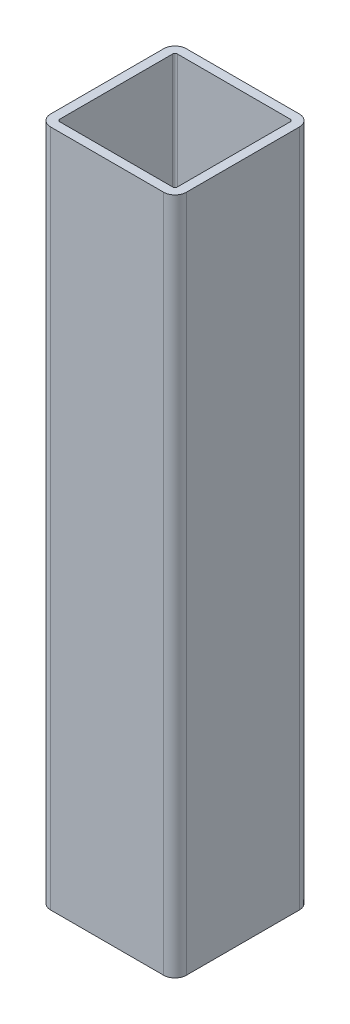
ISO-10303-21;
HEADER;
FILE_DESCRIPTION(('STEP AP214'),'2;1');
FILE_NAME('part.step','',(''),(''),'','','');
FILE_SCHEMA(('AUTOMOTIVE_DESIGN { 1 0 10303 214 1 1 1 1 }'));
ENDSEC;
DATA;
#1=APPLICATION_CONTEXT('core data for automotive mechanical design processes');
#2=APPLICATION_PROTOCOL_DEFINITION('international standard','automotive_design',2000,#1);
#3=PRODUCT_CONTEXT('',#1,'mechanical');
#4=PRODUCT('Part','Part','',(#3));
#5=PRODUCT_RELATED_PRODUCT_CATEGORY('part','',(#4));
#6=PRODUCT_DEFINITION_FORMATION('','',#4);
#7=PRODUCT_DEFINITION_CONTEXT('part definition',#1,'design');
#8=PRODUCT_DEFINITION('design','',#6,#7);
#9=PRODUCT_DEFINITION_SHAPE('','',#8);
#10=(LENGTH_UNIT() NAMED_UNIT(*) SI_UNIT(.MILLI.,.METRE.));
#11=(NAMED_UNIT(*) PLANE_ANGLE_UNIT() SI_UNIT($,.RADIAN.));
#12=(NAMED_UNIT(*) SI_UNIT($,.STERADIAN.) SOLID_ANGLE_UNIT());
#13=UNCERTAINTY_MEASURE_WITH_UNIT(LENGTH_MEASURE(1.E-05),#10,'distance_accuracy_value','');
#14=(GEOMETRIC_REPRESENTATION_CONTEXT(3) GLOBAL_UNCERTAINTY_ASSIGNED_CONTEXT((#13)) GLOBAL_UNIT_ASSIGNED_CONTEXT((#10,
#11,#12)) REPRESENTATION_CONTEXT('',''));
#15=CARTESIAN_POINT('',(0.,0.,0.));
#16=DIRECTION('',(0.,0.,1.));
#17=DIRECTION('',(1.,0.,0.));
#18=AXIS2_PLACEMENT_3D('',#15,#16,#17);
#19=CARTESIAN_POINT('',(-15.875,95.25,15.875));
#20=DIRECTION('',(0.,1.,0.));
#21=DIRECTION('',(0.,0.,1.));
#22=AXIS2_PLACEMENT_3D('',#19,#20,#21);
#23=PLANE('',#22);
#24=CARTESIAN_POINT('',(-15.875,95.25,15.875));
#25=DIRECTION('',(0.,1.,0.));
#26=DIRECTION('',(0.,0.,1.));
#27=AXIS2_PLACEMENT_3D('',#24,#25,#26);
#28=CIRCLE('',#27,3.175);
#29=CARTESIAN_POINT('',(-19.05,95.25,15.875));
#30=VERTEX_POINT('',#29);
#31=CARTESIAN_POINT('',(-15.875,95.25,19.05));
#32=VERTEX_POINT('',#31);
#33=EDGE_CURVE('E259',#30,#32,#28,.T.);
#34=ORIENTED_EDGE('',*,*,#33,.T.);
#35=DIRECTION('',(1.,0.,0.));
#36=VECTOR('',#35,1.);
#37=CARTESIAN_POINT('',(-15.875,95.25,19.05));
#38=LINE('',#37,#36);
#39=CARTESIAN_POINT('',(15.875,95.25,19.05));
#40=VERTEX_POINT('',#39);
#41=EDGE_CURVE('E262',#32,#40,#38,.T.);
#42=ORIENTED_EDGE('',*,*,#41,.T.);
#43=CARTESIAN_POINT('',(15.875,95.25,15.875));
#44=DIRECTION('',(0.,1.,0.));
#45=DIRECTION('',(0.,0.,1.));
#46=AXIS2_PLACEMENT_3D('',#43,#44,#45);
#47=CIRCLE('',#46,3.175);
#48=CARTESIAN_POINT('',(19.05,95.25,15.875));
#49=VERTEX_POINT('',#48);
#50=EDGE_CURVE('E265',#40,#49,#47,.T.);
#51=ORIENTED_EDGE('',*,*,#50,.T.);
#52=DIRECTION('',(0.,0.,-1.));
#53=VECTOR('',#52,1.);
#54=CARTESIAN_POINT('',(19.05,95.25,-15.875));
#55=LINE('',#54,#53);
#56=CARTESIAN_POINT('',(19.05,95.25,-15.875));
#57=VERTEX_POINT('',#56);
#58=EDGE_CURVE('E267',#49,#57,#55,.T.);
#59=ORIENTED_EDGE('',*,*,#58,.T.);
#60=CARTESIAN_POINT('',(15.875,95.25,-15.875));
#61=DIRECTION('',(0.,1.,0.));
#62=DIRECTION('',(0.,0.,1.));
#63=AXIS2_PLACEMENT_3D('',#60,#61,#62);
#64=CIRCLE('',#63,3.175);
#65=CARTESIAN_POINT('',(15.875,95.25,-19.05));
#66=VERTEX_POINT('',#65);
#67=EDGE_CURVE('E269',#57,#66,#64,.T.);
#68=ORIENTED_EDGE('',*,*,#67,.T.);
#69=DIRECTION('',(-1.,0.,0.));
#70=VECTOR('',#69,1.);
#71=CARTESIAN_POINT('',(-15.875,95.25,-19.05));
#72=LINE('',#71,#70);
#73=CARTESIAN_POINT('',(-15.875,95.25,-19.05));
#74=VERTEX_POINT('',#73);
#75=EDGE_CURVE('E271',#66,#74,#72,.T.);
#76=ORIENTED_EDGE('',*,*,#75,.T.);
#77=CARTESIAN_POINT('',(-15.875,95.25,-15.875));
#78=DIRECTION('',(0.,1.,0.));
#79=DIRECTION('',(0.,0.,1.));
#80=AXIS2_PLACEMENT_3D('',#77,#78,#79);
#81=CIRCLE('',#80,3.175);
#82=CARTESIAN_POINT('',(-19.05,95.25,-15.875));
#83=VERTEX_POINT('',#82);
#84=EDGE_CURVE('E273',#74,#83,#81,.T.);
#85=ORIENTED_EDGE('',*,*,#84,.T.);
#86=DIRECTION('',(0.,0.,1.));
#87=VECTOR('',#86,1.);
#88=CARTESIAN_POINT('',(-19.05,95.25,-15.875));
#89=LINE('',#88,#87);
#90=EDGE_CURVE('E275',#83,#30,#89,.T.);
#91=ORIENTED_EDGE('',*,*,#90,.T.);
#92=EDGE_LOOP('',(#34,#42,#51,#59,#68,#76,#85,#91));
#93=FACE_BOUND('',#92,.T.);
#94=DIRECTION('',(1.,0.,0.));
#95=VECTOR('',#94,1.);
#96=CARTESIAN_POINT('',(-15.875,95.25,16.51));
#97=LINE('',#96,#95);
#98=CARTESIAN_POINT('',(-15.875,95.25,16.51));
#99=VERTEX_POINT('',#98);
#100=CARTESIAN_POINT('',(15.875,95.25,16.51));
#101=VERTEX_POINT('',#100);
#102=EDGE_CURVE('E202',#99,#101,#97,.T.);
#103=ORIENTED_EDGE('',*,*,#102,.F.);
#104=CARTESIAN_POINT('',(-15.875,95.25,15.875));
#105=DIRECTION('',(0.,1.,0.));
#106=DIRECTION('',(1.,0.,0.));
#107=AXIS2_PLACEMENT_3D('',#104,#105,#106);
#108=CIRCLE('',#107,0.635000000000002);
#109=CARTESIAN_POINT('',(-16.51,95.25,15.875));
#110=VERTEX_POINT('',#109);
#111=EDGE_CURVE('E194',#110,#99,#108,.T.);
#112=ORIENTED_EDGE('',*,*,#111,.F.);
#113=DIRECTION('',(0.,0.,1.));
#114=VECTOR('',#113,1.);
#115=CARTESIAN_POINT('',(-16.51,95.25,-15.875));
#116=LINE('',#115,#114);
#117=CARTESIAN_POINT('',(-16.51,95.25,-15.875));
#118=VERTEX_POINT('',#117);
#119=EDGE_CURVE('E227',#118,#110,#116,.T.);
#120=ORIENTED_EDGE('',*,*,#119,.F.);
#121=CARTESIAN_POINT('',(-15.875,95.25,-15.875));
#122=DIRECTION('',(0.,1.,0.));
#123=DIRECTION('',(1.,0.,0.));
#124=AXIS2_PLACEMENT_3D('',#121,#122,#123);
#125=CIRCLE('',#124,0.635000000000004);
#126=CARTESIAN_POINT('',(-15.875,95.25,-16.51));
#127=VERTEX_POINT('',#126);
#128=EDGE_CURVE('E225',#127,#118,#125,.T.);
#129=ORIENTED_EDGE('',*,*,#128,.F.);
#130=DIRECTION('',(-1.,0.,0.));
#131=VECTOR('',#130,1.);
#132=CARTESIAN_POINT('',(-15.875,95.25,-16.51));
#133=LINE('',#132,#131);
#134=CARTESIAN_POINT('',(15.875,95.25,-16.51));
#135=VERTEX_POINT('',#134);
#136=EDGE_CURVE('E223',#135,#127,#133,.T.);
#137=ORIENTED_EDGE('',*,*,#136,.F.);
#138=CARTESIAN_POINT('',(15.875,95.25,-15.875));
#139=DIRECTION('',(0.,1.,0.));
#140=DIRECTION('',(1.,0.,0.));
#141=AXIS2_PLACEMENT_3D('',#138,#139,#140);
#142=CIRCLE('',#141,0.635000000000004);
#143=CARTESIAN_POINT('',(16.51,95.25,-15.875));
#144=VERTEX_POINT('',#143);
#145=EDGE_CURVE('E221',#144,#135,#142,.T.);
#146=ORIENTED_EDGE('',*,*,#145,.F.);
#147=DIRECTION('',(0.,0.,-1.));
#148=VECTOR('',#147,1.);
#149=CARTESIAN_POINT('',(16.51,95.25,-15.875));
#150=LINE('',#149,#148);
#151=CARTESIAN_POINT('',(16.51,95.25,15.875));
#152=VERTEX_POINT('',#151);
#153=EDGE_CURVE('E217',#152,#144,#150,.T.);
#154=ORIENTED_EDGE('',*,*,#153,.F.);
#155=CARTESIAN_POINT('',(15.875,95.25,15.875));
#156=DIRECTION('',(0.,1.,0.));
#157=DIRECTION('',(1.,0.,0.));
#158=AXIS2_PLACEMENT_3D('',#155,#156,#157);
#159=CIRCLE('',#158,0.634999999999999);
#160=EDGE_CURVE('E215',#101,#152,#159,.T.);
#161=ORIENTED_EDGE('',*,*,#160,.F.);
#162=EDGE_LOOP('',(#103,#112,#120,#129,#137,#146,#154,#161));
#163=FACE_BOUND('',#162,.T.);
#164=ADVANCED_FACE('F81',(#93,#163),#23,.T.);
#165=CARTESIAN_POINT('',(-15.875,-95.25,15.875));
#166=DIRECTION('',(0.,1.,0.));
#167=DIRECTION('',(0.,0.,1.));
#168=AXIS2_PLACEMENT_3D('',#165,#166,#167);
#169=PLANE('',#168);
#170=CARTESIAN_POINT('',(-15.875,-95.25,15.875));
#171=DIRECTION('',(0.,1.,0.));
#172=DIRECTION('',(0.,0.,1.));
#173=AXIS2_PLACEMENT_3D('',#170,#171,#172);
#174=CIRCLE('',#173,3.175);
#175=CARTESIAN_POINT('',(-19.05,-95.25,15.875));
#176=VERTEX_POINT('',#175);
#177=CARTESIAN_POINT('',(-15.875,-95.25,19.05));
#178=VERTEX_POINT('',#177);
#179=EDGE_CURVE('E210',#176,#178,#174,.T.);
#180=ORIENTED_EDGE('',*,*,#179,.F.);
#181=DIRECTION('',(0.,0.,1.));
#182=VECTOR('',#181,1.);
#183=CARTESIAN_POINT('',(-19.05,-95.25,-15.875));
#184=LINE('',#183,#182);
#185=CARTESIAN_POINT('',(-19.05,-95.25,-15.875));
#186=VERTEX_POINT('',#185);
#187=EDGE_CURVE('E263',#186,#176,#184,.T.);
#188=ORIENTED_EDGE('',*,*,#187,.F.);
#189=CARTESIAN_POINT('',(-15.875,-95.25,-15.875));
#190=DIRECTION('',(0.,1.,0.));
#191=DIRECTION('',(0.,0.,1.));
#192=AXIS2_PLACEMENT_3D('',#189,#190,#191);
#193=CIRCLE('',#192,3.175);
#194=CARTESIAN_POINT('',(-15.875,-95.25,-19.05));
#195=VERTEX_POINT('',#194);
#196=EDGE_CURVE('E290',#195,#186,#193,.T.);
#197=ORIENTED_EDGE('',*,*,#196,.F.);
#198=DIRECTION('',(-1.,0.,0.));
#199=VECTOR('',#198,1.);
#200=CARTESIAN_POINT('',(-15.875,-95.25,-19.05));
#201=LINE('',#200,#199);
#202=CARTESIAN_POINT('',(15.875,-95.25,-19.05));
#203=VERTEX_POINT('',#202);
#204=EDGE_CURVE('E288',#203,#195,#201,.T.);
#205=ORIENTED_EDGE('',*,*,#204,.F.);
#206=CARTESIAN_POINT('',(15.875,-95.25,-15.875));
#207=DIRECTION('',(0.,1.,0.));
#208=DIRECTION('',(0.,0.,1.));
#209=AXIS2_PLACEMENT_3D('',#206,#207,#208);
#210=CIRCLE('',#209,3.175);
#211=CARTESIAN_POINT('',(19.05,-95.25,-15.875));
#212=VERTEX_POINT('',#211);
#213=EDGE_CURVE('E286',#212,#203,#210,.T.);
#214=ORIENTED_EDGE('',*,*,#213,.F.);
#215=DIRECTION('',(0.,0.,-1.));
#216=VECTOR('',#215,1.);
#217=CARTESIAN_POINT('',(19.05,-95.25,-15.875));
#218=LINE('',#217,#216);
#219=CARTESIAN_POINT('',(19.05,-95.25,15.875));
#220=VERTEX_POINT('',#219);
#221=EDGE_CURVE('E284',#220,#212,#218,.T.);
#222=ORIENTED_EDGE('',*,*,#221,.F.);
#223=CARTESIAN_POINT('',(15.875,-95.25,15.875));
#224=DIRECTION('',(0.,1.,0.));
#225=DIRECTION('',(0.,0.,1.));
#226=AXIS2_PLACEMENT_3D('',#223,#224,#225);
#227=CIRCLE('',#226,3.175);
#228=CARTESIAN_POINT('',(15.875,-95.25,19.05));
#229=VERTEX_POINT('',#228);
#230=EDGE_CURVE('E282',#229,#220,#227,.T.);
#231=ORIENTED_EDGE('',*,*,#230,.F.);
#232=DIRECTION('',(1.,0.,0.));
#233=VECTOR('',#232,1.);
#234=CARTESIAN_POINT('',(-15.875,-95.25,19.05));
#235=LINE('',#234,#233);
#236=EDGE_CURVE('E280',#178,#229,#235,.T.);
#237=ORIENTED_EDGE('',*,*,#236,.F.);
#238=EDGE_LOOP('',(#180,#188,#197,#205,#214,#222,#231,#237));
#239=FACE_BOUND('',#238,.T.);
#240=CARTESIAN_POINT('',(-15.875,-95.25,15.875));
#241=DIRECTION('',(0.,1.,0.));
#242=DIRECTION('',(1.,0.,0.));
#243=AXIS2_PLACEMENT_3D('',#240,#241,#242);
#244=CIRCLE('',#243,0.635000000000002);
#245=CARTESIAN_POINT('',(-16.51,-95.25,15.875));
#246=VERTEX_POINT('',#245);
#247=CARTESIAN_POINT('',(-15.875,-95.25,16.51));
#248=VERTEX_POINT('',#247);
#249=EDGE_CURVE('E104',#246,#248,#244,.T.);
#250=ORIENTED_EDGE('',*,*,#249,.T.);
#251=DIRECTION('',(1.,0.,0.));
#252=VECTOR('',#251,1.);
#253=CARTESIAN_POINT('',(-15.875,-95.25,16.51));
#254=LINE('',#253,#252);
#255=CARTESIAN_POINT('',(15.875,-95.25,16.51));
#256=VERTEX_POINT('',#255);
#257=EDGE_CURVE('E209',#248,#256,#254,.T.);
#258=ORIENTED_EDGE('',*,*,#257,.T.);
#259=CARTESIAN_POINT('',(15.875,-95.25,15.875));
#260=DIRECTION('',(0.,1.,0.));
#261=DIRECTION('',(1.,0.,0.));
#262=AXIS2_PLACEMENT_3D('',#259,#260,#261);
#263=CIRCLE('',#262,0.634999999999999);
#264=CARTESIAN_POINT('',(16.51,-95.25,15.875));
#265=VERTEX_POINT('',#264);
#266=EDGE_CURVE('E231',#256,#265,#263,.T.);
#267=ORIENTED_EDGE('',*,*,#266,.T.);
#268=DIRECTION('',(0.,0.,-1.));
#269=VECTOR('',#268,1.);
#270=CARTESIAN_POINT('',(16.51,-95.25,-15.875));
#271=LINE('',#270,#269);
#272=CARTESIAN_POINT('',(16.51,-95.25,-15.875));
#273=VERTEX_POINT('',#272);
#274=EDGE_CURVE('E234',#265,#273,#271,.T.);
#275=ORIENTED_EDGE('',*,*,#274,.T.);
#276=CARTESIAN_POINT('',(15.875,-95.25,-15.875));
#277=DIRECTION('',(0.,1.,0.));
#278=DIRECTION('',(1.,0.,0.));
#279=AXIS2_PLACEMENT_3D('',#276,#277,#278);
#280=CIRCLE('',#279,0.635000000000004);
#281=CARTESIAN_POINT('',(15.875,-95.25,-16.51));
#282=VERTEX_POINT('',#281);
#283=EDGE_CURVE('E237',#273,#282,#280,.T.);
#284=ORIENTED_EDGE('',*,*,#283,.T.);
#285=DIRECTION('',(-1.,0.,0.));
#286=VECTOR('',#285,1.);
#287=CARTESIAN_POINT('',(-15.875,-95.25,-16.51));
#288=LINE('',#287,#286);
#289=CARTESIAN_POINT('',(-15.875,-95.25,-16.51));
#290=VERTEX_POINT('',#289);
#291=EDGE_CURVE('E240',#282,#290,#288,.T.);
#292=ORIENTED_EDGE('',*,*,#291,.T.);
#293=CARTESIAN_POINT('',(-15.875,-95.25,-15.875));
#294=DIRECTION('',(0.,1.,0.));
#295=DIRECTION('',(1.,0.,0.));
#296=AXIS2_PLACEMENT_3D('',#293,#294,#295);
#297=CIRCLE('',#296,0.635000000000004);
#298=CARTESIAN_POINT('',(-16.51,-95.25,-15.875));
#299=VERTEX_POINT('',#298);
#300=EDGE_CURVE('E243',#290,#299,#297,.T.);
#301=ORIENTED_EDGE('',*,*,#300,.T.);
#302=DIRECTION('',(0.,0.,1.));
#303=VECTOR('',#302,1.);
#304=CARTESIAN_POINT('',(-16.51,-95.25,-15.875));
#305=LINE('',#304,#303);
#306=EDGE_CURVE('E203',#299,#246,#305,.T.);
#307=ORIENTED_EDGE('',*,*,#306,.T.);
#308=EDGE_LOOP('',(#250,#258,#267,#275,#284,#292,#301,#307));
#309=FACE_BOUND('',#308,.T.);
#310=ADVANCED_FACE('F320',(#239,#309),#169,.F.);
#311=CARTESIAN_POINT('',(-15.875,95.25,15.875));
#312=DIRECTION('',(0.,-1.,0.));
#313=DIRECTION('',(0.,0.,-1.));
#314=AXIS2_PLACEMENT_3D('',#311,#312,#313);
#315=CYLINDRICAL_SURFACE('',#314,3.175);
#316=ORIENTED_EDGE('',*,*,#179,.T.);
#317=DIRECTION('',(0.,-1.,0.));
#318=VECTOR('',#317,1.);
#319=CARTESIAN_POINT('',(-15.875,95.25,19.05));
#320=LINE('',#319,#318);
#321=EDGE_CURVE('E12',#32,#178,#320,.T.);
#322=ORIENTED_EDGE('',*,*,#321,.F.);
#323=ORIENTED_EDGE('',*,*,#33,.F.);
#324=DIRECTION('',(0.,-1.,0.));
#325=VECTOR('',#324,1.);
#326=CARTESIAN_POINT('',(-19.05,95.25,15.875));
#327=LINE('',#326,#325);
#328=EDGE_CURVE('E277',#30,#176,#327,.T.);
#329=ORIENTED_EDGE('',*,*,#328,.T.);
#330=EDGE_LOOP('',(#316,#322,#323,#329));
#331=FACE_BOUND('',#330,.T.);
#332=ADVANCED_FACE('F83',(#331),#315,.T.);
#333=CARTESIAN_POINT('',(-15.875,95.25,19.05));
#334=DIRECTION('',(0.,0.,-1.));
#335=DIRECTION('',(-1.,0.,0.));
#336=AXIS2_PLACEMENT_3D('',#333,#334,#335);
#337=PLANE('',#336);
#338=ORIENTED_EDGE('',*,*,#236,.T.);
#339=DIRECTION('',(0.,-1.,0.));
#340=VECTOR('',#339,1.);
#341=CARTESIAN_POINT('',(15.875,95.25,19.05));
#342=LINE('',#341,#340);
#343=EDGE_CURVE('E89',#40,#229,#342,.T.);
#344=ORIENTED_EDGE('',*,*,#343,.F.);
#345=ORIENTED_EDGE('',*,*,#41,.F.);
#346=ORIENTED_EDGE('',*,*,#321,.T.);
#347=EDGE_LOOP('',(#338,#344,#345,#346));
#348=FACE_BOUND('',#347,.T.);
#349=ADVANCED_FACE('F337',(#348),#337,.F.);
#350=CARTESIAN_POINT('',(15.875,95.25,15.875));
#351=DIRECTION('',(0.,-1.,0.));
#352=DIRECTION('',(0.,0.,-1.));
#353=AXIS2_PLACEMENT_3D('',#350,#351,#352);
#354=CYLINDRICAL_SURFACE('',#353,3.175);
#355=ORIENTED_EDGE('',*,*,#230,.T.);
#356=DIRECTION('',(0.,-1.,0.));
#357=VECTOR('',#356,1.);
#358=CARTESIAN_POINT('',(19.05,95.25,15.875));
#359=LINE('',#358,#357);
#360=EDGE_CURVE('E307',#49,#220,#359,.T.);
#361=ORIENTED_EDGE('',*,*,#360,.F.);
#362=ORIENTED_EDGE('',*,*,#50,.F.);
#363=ORIENTED_EDGE('',*,*,#343,.T.);
#364=EDGE_LOOP('',(#355,#361,#362,#363));
#365=FACE_BOUND('',#364,.T.);
#366=ADVANCED_FACE('F314',(#365),#354,.T.);
#367=CARTESIAN_POINT('',(19.05,95.25,-15.875));
#368=DIRECTION('',(-1.,0.,0.));
#369=DIRECTION('',(0.,0.,1.));
#370=AXIS2_PLACEMENT_3D('',#367,#368,#369);
#371=PLANE('',#370);
#372=ORIENTED_EDGE('',*,*,#221,.T.);
#373=DIRECTION('',(0.,-1.,0.));
#374=VECTOR('',#373,1.);
#375=CARTESIAN_POINT('',(19.05,95.25,-15.875));
#376=LINE('',#375,#374);
#377=EDGE_CURVE('E304',#57,#212,#376,.T.);
#378=ORIENTED_EDGE('',*,*,#377,.F.);
#379=ORIENTED_EDGE('',*,*,#58,.F.);
#380=ORIENTED_EDGE('',*,*,#360,.T.);
#381=EDGE_LOOP('',(#372,#378,#379,#380));
#382=FACE_BOUND('',#381,.T.);
#383=ADVANCED_FACE('F326',(#382),#371,.F.);
#384=CARTESIAN_POINT('',(15.875,95.25,-15.875));
#385=DIRECTION('',(0.,-1.,0.));
#386=DIRECTION('',(0.,0.,-1.));
#387=AXIS2_PLACEMENT_3D('',#384,#385,#386);
#388=CYLINDRICAL_SURFACE('',#387,3.175);
#389=ORIENTED_EDGE('',*,*,#213,.T.);
#390=DIRECTION('',(0.,-1.,0.));
#391=VECTOR('',#390,1.);
#392=CARTESIAN_POINT('',(15.875,95.25,-19.05));
#393=LINE('',#392,#391);
#394=EDGE_CURVE('E301',#66,#203,#393,.T.);
#395=ORIENTED_EDGE('',*,*,#394,.F.);
#396=ORIENTED_EDGE('',*,*,#67,.F.);
#397=ORIENTED_EDGE('',*,*,#377,.T.);
#398=EDGE_LOOP('',(#389,#395,#396,#397));
#399=FACE_BOUND('',#398,.T.);
#400=ADVANCED_FACE('F330',(#399),#388,.T.);
#401=CARTESIAN_POINT('',(-15.875,95.25,-19.05));
#402=DIRECTION('',(0.,0.,1.));
#403=DIRECTION('',(1.,0.,0.));
#404=AXIS2_PLACEMENT_3D('',#401,#402,#403);
#405=PLANE('',#404);
#406=ORIENTED_EDGE('',*,*,#204,.T.);
#407=DIRECTION('',(0.,-1.,0.));
#408=VECTOR('',#407,1.);
#409=CARTESIAN_POINT('',(-15.875,95.25,-19.05));
#410=LINE('',#409,#408);
#411=EDGE_CURVE('E298',#74,#195,#410,.T.);
#412=ORIENTED_EDGE('',*,*,#411,.F.);
#413=ORIENTED_EDGE('',*,*,#75,.F.);
#414=ORIENTED_EDGE('',*,*,#394,.T.);
#415=EDGE_LOOP('',(#406,#412,#413,#414));
#416=FACE_BOUND('',#415,.T.);
#417=ADVANCED_FACE('F350',(#416),#405,.F.);
#418=CARTESIAN_POINT('',(-15.875,95.25,-15.875));
#419=DIRECTION('',(0.,-1.,0.));
#420=DIRECTION('',(0.,0.,-1.));
#421=AXIS2_PLACEMENT_3D('',#418,#419,#420);
#422=CYLINDRICAL_SURFACE('',#421,3.175);
#423=ORIENTED_EDGE('',*,*,#196,.T.);
#424=DIRECTION('',(0.,-1.,0.));
#425=VECTOR('',#424,1.);
#426=CARTESIAN_POINT('',(-19.05,95.25,-15.875));
#427=LINE('',#426,#425);
#428=EDGE_CURVE('E295',#83,#186,#427,.T.);
#429=ORIENTED_EDGE('',*,*,#428,.F.);
#430=ORIENTED_EDGE('',*,*,#84,.F.);
#431=ORIENTED_EDGE('',*,*,#411,.T.);
#432=EDGE_LOOP('',(#423,#429,#430,#431));
#433=FACE_BOUND('',#432,.T.);
#434=ADVANCED_FACE('F348',(#433),#422,.T.);
#435=CARTESIAN_POINT('',(-19.05,95.25,-15.875));
#436=DIRECTION('',(1.,0.,0.));
#437=DIRECTION('',(0.,0.,-1.));
#438=AXIS2_PLACEMENT_3D('',#435,#436,#437);
#439=PLANE('',#438);
#440=ORIENTED_EDGE('',*,*,#187,.T.);
#441=ORIENTED_EDGE('',*,*,#328,.F.);
#442=ORIENTED_EDGE('',*,*,#90,.F.);
#443=ORIENTED_EDGE('',*,*,#428,.T.);
#444=EDGE_LOOP('',(#440,#441,#442,#443));
#445=FACE_BOUND('',#444,.T.);
#446=ADVANCED_FACE('F343',(#445),#439,.F.);
#447=CARTESIAN_POINT('',(-15.875,95.25,15.875));
#448=DIRECTION('',(0.,-1.,0.));
#449=DIRECTION('',(0.,0.,-1.));
#450=AXIS2_PLACEMENT_3D('',#447,#448,#449);
#451=CYLINDRICAL_SURFACE('',#450,0.635000000000002);
#452=ORIENTED_EDGE('',*,*,#249,.F.);
#453=DIRECTION('',(0.,-1.,0.));
#454=VECTOR('',#453,1.);
#455=CARTESIAN_POINT('',(-16.51,95.25,15.875));
#456=LINE('',#455,#454);
#457=EDGE_CURVE('E198',#110,#246,#456,.T.);
#458=ORIENTED_EDGE('',*,*,#457,.F.);
#459=ORIENTED_EDGE('',*,*,#111,.T.);
#460=DIRECTION('',(0.,-1.,0.));
#461=VECTOR('',#460,1.);
#462=CARTESIAN_POINT('',(-15.875,95.25,16.51));
#463=LINE('',#462,#461);
#464=EDGE_CURVE('E197',#99,#248,#463,.T.);
#465=ORIENTED_EDGE('',*,*,#464,.T.);
#466=EDGE_LOOP('',(#452,#458,#459,#465));
#467=FACE_BOUND('',#466,.T.);
#468=ADVANCED_FACE('F196',(#467),#451,.F.);
#469=CARTESIAN_POINT('',(-15.875,95.25,16.51));
#470=DIRECTION('',(0.,0.,-1.));
#471=DIRECTION('',(-1.,0.,0.));
#472=AXIS2_PLACEMENT_3D('',#469,#470,#471);
#473=PLANE('',#472);
#474=ORIENTED_EDGE('',*,*,#257,.F.);
#475=ORIENTED_EDGE('',*,*,#464,.F.);
#476=ORIENTED_EDGE('',*,*,#102,.T.);
#477=DIRECTION('',(0.,-1.,0.));
#478=VECTOR('',#477,1.);
#479=CARTESIAN_POINT('',(15.875,95.25,16.51));
#480=LINE('',#479,#478);
#481=EDGE_CURVE('E211',#101,#256,#480,.T.);
#482=ORIENTED_EDGE('',*,*,#481,.T.);
#483=EDGE_LOOP('',(#474,#475,#476,#482));
#484=FACE_BOUND('',#483,.T.);
#485=ADVANCED_FACE('F206',(#484),#473,.T.);
#486=CARTESIAN_POINT('',(15.875,95.25,15.875));
#487=DIRECTION('',(0.,-1.,0.));
#488=DIRECTION('',(0.,0.,-1.));
#489=AXIS2_PLACEMENT_3D('',#486,#487,#488);
#490=CYLINDRICAL_SURFACE('',#489,0.634999999999999);
#491=ORIENTED_EDGE('',*,*,#266,.F.);
#492=ORIENTED_EDGE('',*,*,#481,.F.);
#493=ORIENTED_EDGE('',*,*,#160,.T.);
#494=DIRECTION('',(0.,-1.,0.));
#495=VECTOR('',#494,1.);
#496=CARTESIAN_POINT('',(16.51,95.25,15.875));
#497=LINE('',#496,#495);
#498=EDGE_CURVE('E256',#152,#265,#497,.T.);
#499=ORIENTED_EDGE('',*,*,#498,.T.);
#500=EDGE_LOOP('',(#491,#492,#493,#499));
#501=FACE_BOUND('',#500,.T.);
#502=ADVANCED_FACE('F375',(#501),#490,.F.);
#503=CARTESIAN_POINT('',(16.51,95.25,-15.875));
#504=DIRECTION('',(-1.,0.,0.));
#505=DIRECTION('',(0.,0.,1.));
#506=AXIS2_PLACEMENT_3D('',#503,#504,#505);
#507=PLANE('',#506);
#508=ORIENTED_EDGE('',*,*,#274,.F.);
#509=ORIENTED_EDGE('',*,*,#498,.F.);
#510=ORIENTED_EDGE('',*,*,#153,.T.);
#511=DIRECTION('',(0.,-1.,0.));
#512=VECTOR('',#511,1.);
#513=CARTESIAN_POINT('',(16.51,95.25,-15.875));
#514=LINE('',#513,#512);
#515=EDGE_CURVE('E254',#144,#273,#514,.T.);
#516=ORIENTED_EDGE('',*,*,#515,.T.);
#517=EDGE_LOOP('',(#508,#509,#510,#516));
#518=FACE_BOUND('',#517,.T.);
#519=ADVANCED_FACE('F379',(#518),#507,.T.);
#520=CARTESIAN_POINT('',(15.875,95.25,-15.875));
#521=DIRECTION('',(0.,-1.,0.));
#522=DIRECTION('',(0.,0.,-1.));
#523=AXIS2_PLACEMENT_3D('',#520,#521,#522);
#524=CYLINDRICAL_SURFACE('',#523,0.635000000000004);
#525=ORIENTED_EDGE('',*,*,#283,.F.);
#526=ORIENTED_EDGE('',*,*,#515,.F.);
#527=ORIENTED_EDGE('',*,*,#145,.T.);
#528=DIRECTION('',(0.,-1.,0.));
#529=VECTOR('',#528,1.);
#530=CARTESIAN_POINT('',(15.875,95.25,-16.51));
#531=LINE('',#530,#529);
#532=EDGE_CURVE('E252',#135,#282,#531,.T.);
#533=ORIENTED_EDGE('',*,*,#532,.T.);
#534=EDGE_LOOP('',(#525,#526,#527,#533));
#535=FACE_BOUND('',#534,.T.);
#536=ADVANCED_FACE('F385',(#535),#524,.F.);
#537=CARTESIAN_POINT('',(-15.875,95.25,-16.51));
#538=DIRECTION('',(0.,0.,1.));
#539=DIRECTION('',(1.,0.,0.));
#540=AXIS2_PLACEMENT_3D('',#537,#538,#539);
#541=PLANE('',#540);
#542=ORIENTED_EDGE('',*,*,#291,.F.);
#543=ORIENTED_EDGE('',*,*,#532,.F.);
#544=ORIENTED_EDGE('',*,*,#136,.T.);
#545=DIRECTION('',(0.,-1.,0.));
#546=VECTOR('',#545,1.);
#547=CARTESIAN_POINT('',(-15.875,95.25,-16.51));
#548=LINE('',#547,#546);
#549=EDGE_CURVE('E250',#127,#290,#548,.T.);
#550=ORIENTED_EDGE('',*,*,#549,.T.);
#551=EDGE_LOOP('',(#542,#543,#544,#550));
#552=FACE_BOUND('',#551,.T.);
#553=ADVANCED_FACE('F389',(#552),#541,.T.);
#554=CARTESIAN_POINT('',(-15.875,95.25,-15.875));
#555=DIRECTION('',(0.,-1.,0.));
#556=DIRECTION('',(0.,0.,-1.));
#557=AXIS2_PLACEMENT_3D('',#554,#555,#556);
#558=CYLINDRICAL_SURFACE('',#557,0.635000000000004);
#559=ORIENTED_EDGE('',*,*,#300,.F.);
#560=ORIENTED_EDGE('',*,*,#549,.F.);
#561=ORIENTED_EDGE('',*,*,#128,.T.);
#562=DIRECTION('',(0.,-1.,0.));
#563=VECTOR('',#562,1.);
#564=CARTESIAN_POINT('',(-16.51,95.25,-15.875));
#565=LINE('',#564,#563);
#566=EDGE_CURVE('E96',#118,#299,#565,.T.);
#567=ORIENTED_EDGE('',*,*,#566,.T.);
#568=EDGE_LOOP('',(#559,#560,#561,#567));
#569=FACE_BOUND('',#568,.T.);
#570=ADVANCED_FACE('F393',(#569),#558,.F.);
#571=CARTESIAN_POINT('',(-16.51,95.25,-15.875));
#572=DIRECTION('',(1.,0.,0.));
#573=DIRECTION('',(0.,0.,-1.));
#574=AXIS2_PLACEMENT_3D('',#571,#572,#573);
#575=PLANE('',#574);
#576=ORIENTED_EDGE('',*,*,#306,.F.);
#577=ORIENTED_EDGE('',*,*,#566,.F.);
#578=ORIENTED_EDGE('',*,*,#119,.T.);
#579=ORIENTED_EDGE('',*,*,#457,.T.);
#580=EDGE_LOOP('',(#576,#577,#578,#579));
#581=FACE_BOUND('',#580,.T.);
#582=ADVANCED_FACE('F397',(#581),#575,.T.);
#583=CLOSED_SHELL('',(#164,#310,#332,#349,#366,#383,#400,#417,#434,#446,#468,#485,#502,#519,
#536,#553,#570,#582));
#584=MANIFOLD_SOLID_BREP('B2',#583);
#585=ADVANCED_BREP_SHAPE_REPRESENTATION('',(#18,#584),#14);
#586=SHAPE_DEFINITION_REPRESENTATION(#9,#585);
ENDSEC;
END-ISO-10303-21;
